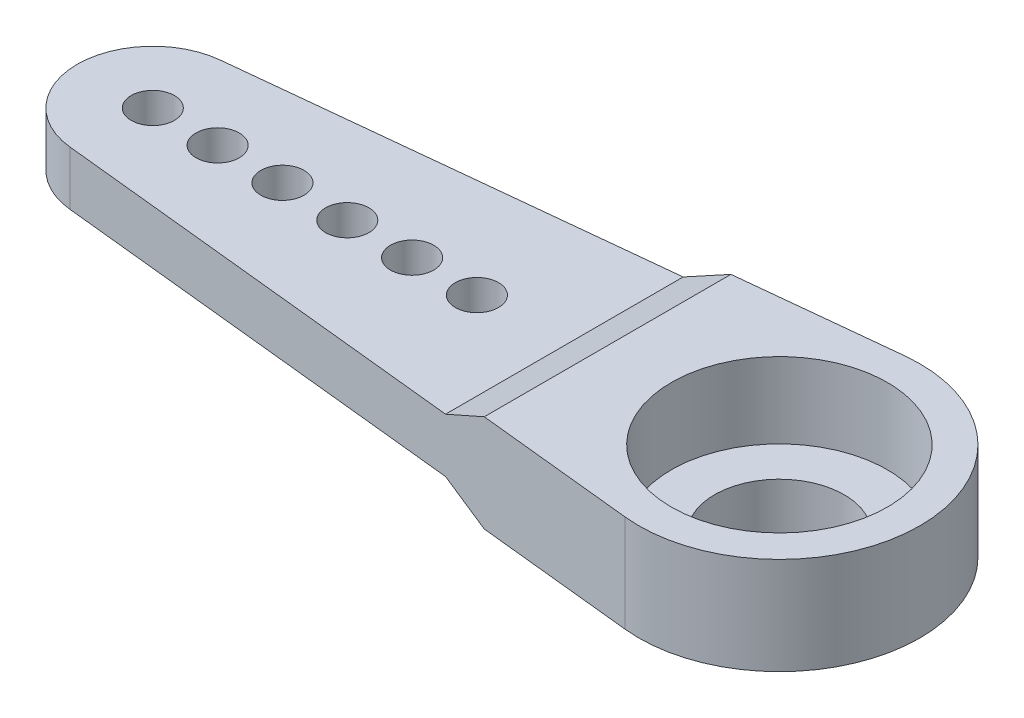
ISO-10303-21;
HEADER;
FILE_DESCRIPTION(('STEP AP214'),'2;1');
FILE_NAME('part.step','',(''),(''),'','','');
FILE_SCHEMA(('AUTOMOTIVE_DESIGN { 1 0 10303 214 1 1 1 1 }'));
ENDSEC;
DATA;
#1=APPLICATION_CONTEXT('core data for automotive mechanical design processes');
#2=APPLICATION_PROTOCOL_DEFINITION('international standard','automotive_design',2000,#1);
#3=PRODUCT_CONTEXT('',#1,'mechanical');
#4=PRODUCT('Part','Part','',(#3));
#5=PRODUCT_RELATED_PRODUCT_CATEGORY('part','',(#4));
#6=PRODUCT_DEFINITION_FORMATION('','',#4);
#7=PRODUCT_DEFINITION_CONTEXT('part definition',#1,'design');
#8=PRODUCT_DEFINITION('design','',#6,#7);
#9=PRODUCT_DEFINITION_SHAPE('','',#8);
#10=(LENGTH_UNIT() NAMED_UNIT(*) SI_UNIT(.MILLI.,.METRE.));
#11=(NAMED_UNIT(*) PLANE_ANGLE_UNIT() SI_UNIT($,.RADIAN.));
#12=(NAMED_UNIT(*) SI_UNIT($,.STERADIAN.) SOLID_ANGLE_UNIT());
#13=UNCERTAINTY_MEASURE_WITH_UNIT(LENGTH_MEASURE(1.E-05),#10,'distance_accuracy_value','');
#14=(GEOMETRIC_REPRESENTATION_CONTEXT(3) GLOBAL_UNCERTAINTY_ASSIGNED_CONTEXT((#13)) GLOBAL_UNIT_ASSIGNED_CONTEXT((#10,
#11,#12)) REPRESENTATION_CONTEXT('',''));
#15=CARTESIAN_POINT('',(0.,0.,0.));
#16=DIRECTION('',(0.,0.,1.));
#17=DIRECTION('',(1.,0.,0.));
#18=AXIS2_PLACEMENT_3D('',#15,#16,#17);
#19=CARTESIAN_POINT('',(0.,0.,0.));
#20=DIRECTION('',(0.,1.,0.));
#21=DIRECTION('',(0.,0.,1.));
#22=AXIS2_PLACEMENT_3D('',#19,#20,#21);
#23=PLANE('',#22);
#24=CARTESIAN_POINT('',(-14.,0.,0.));
#25=DIRECTION('',(0.,1.,0.));
#26=DIRECTION('',(0.,0.,1.));
#27=AXIS2_PLACEMENT_3D('',#24,#25,#26);
#28=CIRCLE('',#27,1.);
#29=CARTESIAN_POINT('',(-14.,0.,1.));
#30=VERTEX_POINT('',#29);
#31=EDGE_CURVE('E201',#30,#30,#28,.T.);
#32=ORIENTED_EDGE('',*,*,#31,.T.);
#33=EDGE_LOOP('',(#32));
#34=FACE_BOUND('',#33,.T.);
#35=CARTESIAN_POINT('',(-17.,0.,0.));
#36=DIRECTION('',(0.,1.,0.));
#37=DIRECTION('',(0.,0.,1.));
#38=AXIS2_PLACEMENT_3D('',#35,#36,#37);
#39=CIRCLE('',#38,1.);
#40=CARTESIAN_POINT('',(-17.,0.,1.));
#41=VERTEX_POINT('',#40);
#42=EDGE_CURVE('E198',#41,#41,#39,.T.);
#43=ORIENTED_EDGE('',*,*,#42,.T.);
#44=EDGE_LOOP('',(#43));
#45=FACE_BOUND('',#44,.T.);
#46=CARTESIAN_POINT('',(-20.,0.,0.));
#47=DIRECTION('',(0.,1.,0.));
#48=DIRECTION('',(0.,0.,1.));
#49=AXIS2_PLACEMENT_3D('',#46,#47,#48);
#50=CIRCLE('',#49,1.);
#51=CARTESIAN_POINT('',(-20.,0.,1.));
#52=VERTEX_POINT('',#51);
#53=EDGE_CURVE('E195',#52,#52,#50,.T.);
#54=ORIENTED_EDGE('',*,*,#53,.T.);
#55=EDGE_LOOP('',(#54));
#56=FACE_BOUND('',#55,.T.);
#57=CARTESIAN_POINT('',(-23.,0.,0.));
#58=DIRECTION('',(0.,1.,0.));
#59=DIRECTION('',(0.,0.,1.));
#60=AXIS2_PLACEMENT_3D('',#57,#58,#59);
#61=CIRCLE('',#60,0.999999999999998);
#62=CARTESIAN_POINT('',(-23.,0.,0.999999999999998));
#63=VERTEX_POINT('',#62);
#64=EDGE_CURVE('E192',#63,#63,#61,.T.);
#65=ORIENTED_EDGE('',*,*,#64,.T.);
#66=EDGE_LOOP('',(#65));
#67=FACE_BOUND('',#66,.T.);
#68=CARTESIAN_POINT('',(-26.,0.,0.));
#69=DIRECTION('',(0.,1.,0.));
#70=DIRECTION('',(0.,0.,1.));
#71=AXIS2_PLACEMENT_3D('',#68,#69,#70);
#72=CIRCLE('',#71,1.);
#73=CARTESIAN_POINT('',(-26.,0.,1.));
#74=VERTEX_POINT('',#73);
#75=EDGE_CURVE('E189',#74,#74,#72,.T.);
#76=ORIENTED_EDGE('',*,*,#75,.T.);
#77=EDGE_LOOP('',(#76));
#78=FACE_BOUND('',#77,.T.);
#79=CARTESIAN_POINT('',(-29.,0.,0.));
#80=DIRECTION('',(0.,1.,0.));
#81=DIRECTION('',(0.,0.,1.));
#82=AXIS2_PLACEMENT_3D('',#79,#80,#81);
#83=CIRCLE('',#82,0.999999999999998);
#84=CARTESIAN_POINT('',(-29.,0.,0.999999999999998));
#85=VERTEX_POINT('',#84);
#86=EDGE_CURVE('E158',#85,#85,#83,.T.);
#87=ORIENTED_EDGE('',*,*,#86,.T.);
#88=EDGE_LOOP('',(#87));
#89=FACE_BOUND('',#88,.T.);
#90=DIRECTION('',(0.,0.,-1.));
#91=VECTOR('',#90,1.);
#92=CARTESIAN_POINT('',(-9.95191462652814,0.,0.));
#93=LINE('',#92,#91);
#94=CARTESIAN_POINT('',(-9.95191462652814,0.,5.5));
#95=VERTEX_POINT('',#94);
#96=CARTESIAN_POINT('',(-9.95191462652814,0.,-5.5));
#97=VERTEX_POINT('',#96);
#98=EDGE_CURVE('E127',#95,#97,#93,.T.);
#99=ORIENTED_EDGE('',*,*,#98,.F.);
#100=DIRECTION('',(0.994634834610756,0.,0.103448275862069));
#101=VECTOR('',#100,1.);
#102=CARTESIAN_POINT('',(-0.672413793103447,0.,6.46512642496991));
#103=LINE('',#102,#101);
#104=CARTESIAN_POINT('',(-29.3620689655172,0.,3.48122192113765));
#105=VERTEX_POINT('',#104);
#106=EDGE_CURVE('E165',#105,#95,#103,.T.);
#107=ORIENTED_EDGE('',*,*,#106,.F.);
#108=CARTESIAN_POINT('',(-29.,0.,0.));
#109=DIRECTION('',(0.,1.,0.));
#110=DIRECTION('',(0.,0.,1.));
#111=AXIS2_PLACEMENT_3D('',#108,#109,#110);
#112=CIRCLE('',#111,3.5);
#113=CARTESIAN_POINT('',(-29.3620689655172,0.,-3.48122192113764));
#114=VERTEX_POINT('',#113);
#115=EDGE_CURVE('E206',#114,#105,#112,.T.);
#116=ORIENTED_EDGE('',*,*,#115,.F.);
#117=DIRECTION('',(-0.994634834610756,0.,0.103448275862069));
#118=VECTOR('',#117,1.);
#119=CARTESIAN_POINT('',(-0.672413793103448,0.,-6.46512642496991));
#120=LINE('',#119,#118);
#121=EDGE_CURVE('E204',#97,#114,#120,.T.);
#122=ORIENTED_EDGE('',*,*,#121,.F.);
#123=EDGE_LOOP('',(#99,#107,#116,#122));
#124=FACE_BOUND('',#123,.T.);
#125=ADVANCED_FACE('F53',(#34,#45,#56,#67,#78,#89,#124),#23,.F.);
#126=CARTESIAN_POINT('',(-0.672413793103448,2.5,-6.46512642496991));
#127=DIRECTION('',(0.103448275862069,0.,0.994634834610756));
#128=DIRECTION('',(0.994634834610756,0.,-0.103448275862069));
#129=AXIS2_PLACEMENT_3D('',#126,#127,#128);
#130=PLANE('',#129);
#131=DIRECTION('',(-0.994634834610756,0.,0.103448275862069));
#132=VECTOR('',#131,1.);
#133=CARTESIAN_POINT('',(-0.672413793103448,2.5,-6.46512642496991));
#134=LINE('',#133,#132);
#135=CARTESIAN_POINT('',(-9.95191462652814,2.5,-5.5));
#136=VERTEX_POINT('',#135);
#137=CARTESIAN_POINT('',(-29.3620689655172,2.5,-3.48122192113764));
#138=VERTEX_POINT('',#137);
#139=EDGE_CURVE('E180',#136,#138,#134,.T.);
#140=ORIENTED_EDGE('',*,*,#139,.F.);
#141=DIRECTION('',(0.890582012116265,0.445291006058129,-0.0926261281641659));
#142=VECTOR('',#141,1.);
#143=CARTESIAN_POINT('',(-8.42277522553789,3.26456970049512,-5.65904011108469));
#144=LINE('',#143,#142);
#145=CARTESIAN_POINT('',(-7.95191462652812,3.5,-5.70801257358446));
#146=VERTEX_POINT('',#145);
#147=EDGE_CURVE('E225',#136,#146,#144,.T.);
#148=ORIENTED_EDGE('',*,*,#147,.T.);
#149=DIRECTION('',(0.994634834610756,0.,-0.103448275862069));
#150=VECTOR('',#149,1.);
#151=CARTESIAN_POINT('',(-0.672413793103448,3.5,-6.46512642496991));
#152=LINE('',#151,#150);
#153=CARTESIAN_POINT('',(-0.67241379310344,3.5,-6.46512642496991));
#154=VERTEX_POINT('',#153);
#155=EDGE_CURVE('E153',#146,#154,#152,.T.);
#156=ORIENTED_EDGE('',*,*,#155,.T.);
#157=DIRECTION('',(0.,-1.,0.));
#158=VECTOR('',#157,1.);
#159=CARTESIAN_POINT('',(-0.67241379310345,2.5,-6.46512642496991));
#160=LINE('',#159,#158);
#161=CARTESIAN_POINT('',(-0.67241379310345,-1.,-6.46512642496991));
#162=VERTEX_POINT('',#161);
#163=EDGE_CURVE('E137',#154,#162,#160,.T.);
#164=ORIENTED_EDGE('',*,*,#163,.T.);
#165=DIRECTION('',(-0.994634834610756,0.,0.103448275862069));
#166=VECTOR('',#165,1.);
#167=CARTESIAN_POINT('',(-0.672413793103448,-1.,-6.46512642496991));
#168=LINE('',#167,#166);
#169=CARTESIAN_POINT('',(-7.95191462652812,-1.,-5.70801257358446));
#170=VERTEX_POINT('',#169);
#171=EDGE_CURVE('E142',#162,#170,#168,.T.);
#172=ORIENTED_EDGE('',*,*,#171,.T.);
#173=DIRECTION('',(0.890582012116265,-0.445291006058129,-0.0926261281641659));
#174=VECTOR('',#173,1.);
#175=CARTESIAN_POINT('',(-8.42277522553789,-0.764569700495117,-5.65904011108469));
#176=LINE('',#175,#174);
#177=EDGE_CURVE('E69',#170,#97,#176,.F.);
#178=ORIENTED_EDGE('',*,*,#177,.T.);
#179=ORIENTED_EDGE('',*,*,#121,.T.);
#180=DIRECTION('',(0.,-1.,0.));
#181=VECTOR('',#180,1.);
#182=CARTESIAN_POINT('',(-29.3620689655172,2.5,-3.48122192113764));
#183=LINE('',#182,#181);
#184=EDGE_CURVE('E212',#138,#114,#183,.T.);
#185=ORIENTED_EDGE('',*,*,#184,.F.);
#186=EDGE_LOOP('',(#140,#148,#156,#164,#172,#178,#179,#185));
#187=FACE_BOUND('',#186,.T.);
#188=ADVANCED_FACE('F243',(#187),#130,.F.);
#189=CARTESIAN_POINT('',(-29.,2.5,0.));
#190=DIRECTION('',(0.,-1.,0.));
#191=DIRECTION('',(0.,0.,-1.));
#192=AXIS2_PLACEMENT_3D('',#189,#190,#191);
#193=CYLINDRICAL_SURFACE('',#192,3.5);
#194=ORIENTED_EDGE('',*,*,#115,.T.);
#195=DIRECTION('',(0.,-1.,0.));
#196=VECTOR('',#195,1.);
#197=CARTESIAN_POINT('',(-29.3620689655172,2.5,3.48122192113765));
#198=LINE('',#197,#196);
#199=CARTESIAN_POINT('',(-29.3620689655172,2.5,3.48122192113765));
#200=VERTEX_POINT('',#199);
#201=EDGE_CURVE('E136',#200,#105,#198,.T.);
#202=ORIENTED_EDGE('',*,*,#201,.F.);
#203=CARTESIAN_POINT('',(-29.,2.5,0.));
#204=DIRECTION('',(0.,1.,0.));
#205=DIRECTION('',(0.,0.,1.));
#206=AXIS2_PLACEMENT_3D('',#203,#204,#205);
#207=CIRCLE('',#206,3.5);
#208=EDGE_CURVE('E182',#138,#200,#207,.T.);
#209=ORIENTED_EDGE('',*,*,#208,.F.);
#210=ORIENTED_EDGE('',*,*,#184,.T.);
#211=EDGE_LOOP('',(#194,#202,#209,#210));
#212=FACE_BOUND('',#211,.T.);
#213=ADVANCED_FACE('F249',(#212),#193,.T.);
#214=CARTESIAN_POINT('',(-0.672413793103447,2.5,6.46512642496991));
#215=DIRECTION('',(0.103448275862069,0.,-0.994634834610756));
#216=DIRECTION('',(-0.994634834610756,0.,-0.103448275862069));
#217=AXIS2_PLACEMENT_3D('',#214,#215,#216);
#218=PLANE('',#217);
#219=DIRECTION('',(-0.994634834610756,0.,-0.103448275862069));
#220=VECTOR('',#219,1.);
#221=CARTESIAN_POINT('',(-0.672413793103447,3.5,6.46512642496991));
#222=LINE('',#221,#220);
#223=CARTESIAN_POINT('',(-0.672413793103448,3.5,6.46512642496991));
#224=VERTEX_POINT('',#223);
#225=CARTESIAN_POINT('',(-7.95191462652813,3.5,5.70801257358446));
#226=VERTEX_POINT('',#225);
#227=EDGE_CURVE('E156',#224,#226,#222,.T.);
#228=ORIENTED_EDGE('',*,*,#227,.T.);
#229=DIRECTION('',(-0.890582012116265,-0.445291006058129,-0.0926261281641657));
#230=VECTOR('',#229,1.);
#231=CARTESIAN_POINT('',(-8.42277522553789,3.26456970049512,5.65904011108469));
#232=LINE('',#231,#230);
#233=CARTESIAN_POINT('',(-9.95191462652814,2.5,5.5));
#234=VERTEX_POINT('',#233);
#235=EDGE_CURVE('E222',#226,#234,#232,.T.);
#236=ORIENTED_EDGE('',*,*,#235,.T.);
#237=DIRECTION('',(0.994634834610756,0.,0.103448275862069));
#238=VECTOR('',#237,1.);
#239=CARTESIAN_POINT('',(-0.672413793103447,2.5,6.46512642496991));
#240=LINE('',#239,#238);
#241=EDGE_CURVE('E184',#200,#234,#240,.T.);
#242=ORIENTED_EDGE('',*,*,#241,.F.);
#243=ORIENTED_EDGE('',*,*,#201,.T.);
#244=ORIENTED_EDGE('',*,*,#106,.T.);
#245=DIRECTION('',(-0.890582012116265,0.445291006058129,-0.0926261281641657));
#246=VECTOR('',#245,1.);
#247=CARTESIAN_POINT('',(-8.42277522553789,-0.764569700495117,5.65904011108469));
#248=LINE('',#247,#246);
#249=CARTESIAN_POINT('',(-7.95191462652812,-1.,5.70801257358446));
#250=VERTEX_POINT('',#249);
#251=EDGE_CURVE('E77',#95,#250,#248,.F.);
#252=ORIENTED_EDGE('',*,*,#251,.T.);
#253=DIRECTION('',(0.994634834610756,0.,0.103448275862069));
#254=VECTOR('',#253,1.);
#255=CARTESIAN_POINT('',(-0.672413793103447,-1.,6.46512642496991));
#256=LINE('',#255,#254);
#257=CARTESIAN_POINT('',(-0.672413793103447,-1.,6.46512642496991));
#258=VERTEX_POINT('',#257);
#259=EDGE_CURVE('E118',#250,#258,#256,.T.);
#260=ORIENTED_EDGE('',*,*,#259,.T.);
#261=DIRECTION('',(0.,-1.,0.));
#262=VECTOR('',#261,1.);
#263=CARTESIAN_POINT('',(-0.672413793103447,2.5,6.46512642496991));
#264=LINE('',#263,#262);
#265=EDGE_CURVE('E122',#224,#258,#264,.T.);
#266=ORIENTED_EDGE('',*,*,#265,.F.);
#267=EDGE_LOOP('',(#228,#236,#242,#243,#244,#252,#260,#266));
#268=FACE_BOUND('',#267,.T.);
#269=ADVANCED_FACE('F121',(#268),#218,.F.);
#270=CARTESIAN_POINT('',(0.,2.5,0.));
#271=DIRECTION('',(0.,-1.,0.));
#272=DIRECTION('',(0.,0.,-1.));
#273=AXIS2_PLACEMENT_3D('',#270,#271,#272);
#274=CYLINDRICAL_SURFACE('',#273,6.5);
#275=ORIENTED_EDGE('',*,*,#265,.T.);
#276=CARTESIAN_POINT('',(0.,-1.,0.));
#277=DIRECTION('',(0.,1.,0.));
#278=DIRECTION('',(0.,0.,1.));
#279=AXIS2_PLACEMENT_3D('',#276,#277,#278);
#280=CIRCLE('',#279,6.5);
#281=EDGE_CURVE('E126',#258,#162,#280,.T.);
#282=ORIENTED_EDGE('',*,*,#281,.T.);
#283=ORIENTED_EDGE('',*,*,#163,.F.);
#284=CARTESIAN_POINT('',(0.,3.5,0.));
#285=DIRECTION('',(0.,1.,0.));
#286=DIRECTION('',(0.,0.,1.));
#287=AXIS2_PLACEMENT_3D('',#284,#285,#286);
#288=CIRCLE('',#287,6.5);
#289=EDGE_CURVE('E134',#224,#154,#288,.T.);
#290=ORIENTED_EDGE('',*,*,#289,.F.);
#291=EDGE_LOOP('',(#275,#282,#283,#290));
#292=FACE_BOUND('',#291,.T.);
#293=ADVANCED_FACE('F131',(#292),#274,.T.);
#294=CARTESIAN_POINT('',(-14.,2.5,0.));
#295=DIRECTION('',(0.,-1.,0.));
#296=DIRECTION('',(0.,0.,-1.));
#297=AXIS2_PLACEMENT_3D('',#294,#295,#296);
#298=CYLINDRICAL_SURFACE('',#297,1.);
#299=CARTESIAN_POINT('',(-14.,2.5,0.));
#300=DIRECTION('',(0.,1.,0.));
#301=DIRECTION('',(0.,0.,1.));
#302=AXIS2_PLACEMENT_3D('',#299,#300,#301);
#303=CIRCLE('',#302,1.);
#304=CARTESIAN_POINT('',(-14.,2.5,1.));
#305=VERTEX_POINT('',#304);
#306=EDGE_CURVE('E177',#305,#305,#303,.T.);
#307=ORIENTED_EDGE('',*,*,#306,.T.);
#308=EDGE_LOOP('',(#307));
#309=FACE_BOUND('',#308,.T.);
#310=ORIENTED_EDGE('',*,*,#31,.F.);
#311=EDGE_LOOP('',(#310));
#312=FACE_BOUND('',#311,.T.);
#313=ADVANCED_FACE('F264',(#309,#312),#298,.F.);
#314=CARTESIAN_POINT('',(-17.,2.5,0.));
#315=DIRECTION('',(0.,-1.,0.));
#316=DIRECTION('',(0.,0.,-1.));
#317=AXIS2_PLACEMENT_3D('',#314,#315,#316);
#318=CYLINDRICAL_SURFACE('',#317,1.);
#319=CARTESIAN_POINT('',(-17.,2.5,0.));
#320=DIRECTION('',(0.,1.,0.));
#321=DIRECTION('',(0.,0.,1.));
#322=AXIS2_PLACEMENT_3D('',#319,#320,#321);
#323=CIRCLE('',#322,1.);
#324=CARTESIAN_POINT('',(-17.,2.5,1.));
#325=VERTEX_POINT('',#324);
#326=EDGE_CURVE('E174',#325,#325,#323,.T.);
#327=ORIENTED_EDGE('',*,*,#326,.T.);
#328=EDGE_LOOP('',(#327));
#329=FACE_BOUND('',#328,.T.);
#330=ORIENTED_EDGE('',*,*,#42,.F.);
#331=EDGE_LOOP('',(#330));
#332=FACE_BOUND('',#331,.T.);
#333=ADVANCED_FACE('F272',(#329,#332),#318,.F.);
#334=CARTESIAN_POINT('',(-20.,2.5,0.));
#335=DIRECTION('',(0.,-1.,0.));
#336=DIRECTION('',(0.,0.,-1.));
#337=AXIS2_PLACEMENT_3D('',#334,#335,#336);
#338=CYLINDRICAL_SURFACE('',#337,1.);
#339=CARTESIAN_POINT('',(-20.,2.5,0.));
#340=DIRECTION('',(0.,1.,0.));
#341=DIRECTION('',(0.,0.,1.));
#342=AXIS2_PLACEMENT_3D('',#339,#340,#341);
#343=CIRCLE('',#342,1.);
#344=CARTESIAN_POINT('',(-20.,2.5,1.));
#345=VERTEX_POINT('',#344);
#346=EDGE_CURVE('E171',#345,#345,#343,.T.);
#347=ORIENTED_EDGE('',*,*,#346,.T.);
#348=EDGE_LOOP('',(#347));
#349=FACE_BOUND('',#348,.T.);
#350=ORIENTED_EDGE('',*,*,#53,.F.);
#351=EDGE_LOOP('',(#350));
#352=FACE_BOUND('',#351,.T.);
#353=ADVANCED_FACE('F276',(#349,#352),#338,.F.);
#354=CARTESIAN_POINT('',(-23.,2.5,0.));
#355=DIRECTION('',(0.,-1.,0.));
#356=DIRECTION('',(0.,0.,-1.));
#357=AXIS2_PLACEMENT_3D('',#354,#355,#356);
#358=CYLINDRICAL_SURFACE('',#357,0.999999999999998);
#359=CARTESIAN_POINT('',(-23.,2.5,0.));
#360=DIRECTION('',(0.,1.,0.));
#361=DIRECTION('',(0.,0.,1.));
#362=AXIS2_PLACEMENT_3D('',#359,#360,#361);
#363=CIRCLE('',#362,0.999999999999998);
#364=CARTESIAN_POINT('',(-23.,2.5,0.999999999999998));
#365=VERTEX_POINT('',#364);
#366=EDGE_CURVE('E168',#365,#365,#363,.T.);
#367=ORIENTED_EDGE('',*,*,#366,.T.);
#368=EDGE_LOOP('',(#367));
#369=FACE_BOUND('',#368,.T.);
#370=ORIENTED_EDGE('',*,*,#64,.F.);
#371=EDGE_LOOP('',(#370));
#372=FACE_BOUND('',#371,.T.);
#373=ADVANCED_FACE('F280',(#369,#372),#358,.F.);
#374=CARTESIAN_POINT('',(-26.,2.5,0.));
#375=DIRECTION('',(0.,-1.,0.));
#376=DIRECTION('',(0.,0.,-1.));
#377=AXIS2_PLACEMENT_3D('',#374,#375,#376);
#378=CYLINDRICAL_SURFACE('',#377,1.);
#379=CARTESIAN_POINT('',(-26.,2.5,0.));
#380=DIRECTION('',(0.,1.,0.));
#381=DIRECTION('',(0.,0.,1.));
#382=AXIS2_PLACEMENT_3D('',#379,#380,#381);
#383=CIRCLE('',#382,1.);
#384=CARTESIAN_POINT('',(-26.,2.5,1.));
#385=VERTEX_POINT('',#384);
#386=EDGE_CURVE('E164',#385,#385,#383,.T.);
#387=ORIENTED_EDGE('',*,*,#386,.T.);
#388=EDGE_LOOP('',(#387));
#389=FACE_BOUND('',#388,.T.);
#390=ORIENTED_EDGE('',*,*,#75,.F.);
#391=EDGE_LOOP('',(#390));
#392=FACE_BOUND('',#391,.T.);
#393=ADVANCED_FACE('F284',(#389,#392),#378,.F.);
#394=CARTESIAN_POINT('',(-29.,2.5,0.));
#395=DIRECTION('',(0.,-1.,0.));
#396=DIRECTION('',(0.,0.,-1.));
#397=AXIS2_PLACEMENT_3D('',#394,#395,#396);
#398=CYLINDRICAL_SURFACE('',#397,0.999999999999998);
#399=CARTESIAN_POINT('',(-29.,2.5,0.));
#400=DIRECTION('',(0.,1.,0.));
#401=DIRECTION('',(0.,0.,1.));
#402=AXIS2_PLACEMENT_3D('',#399,#400,#401);
#403=CIRCLE('',#402,0.999999999999998);
#404=CARTESIAN_POINT('',(-29.,2.5,0.999999999999998));
#405=VERTEX_POINT('',#404);
#406=EDGE_CURVE('E161',#405,#405,#403,.T.);
#407=ORIENTED_EDGE('',*,*,#406,.T.);
#408=EDGE_LOOP('',(#407));
#409=FACE_BOUND('',#408,.T.);
#410=ORIENTED_EDGE('',*,*,#86,.F.);
#411=EDGE_LOOP('',(#410));
#412=FACE_BOUND('',#411,.T.);
#413=ADVANCED_FACE('F260',(#409,#412),#398,.F.);
#414=CARTESIAN_POINT('',(0.,2.5,0.));
#415=DIRECTION('',(0.,-1.,0.));
#416=DIRECTION('',(0.,0.,-1.));
#417=AXIS2_PLACEMENT_3D('',#414,#415,#416);
#418=CYLINDRICAL_SURFACE('',#417,5.);
#419=CARTESIAN_POINT('',(0.,0.,0.));
#420=DIRECTION('',(0.,1.,0.));
#421=DIRECTION('',(0.,0.,1.));
#422=AXIS2_PLACEMENT_3D('',#419,#420,#421);
#423=CIRCLE('',#422,5.);
#424=CARTESIAN_POINT('',(0.,0.,5.));
#425=VERTEX_POINT('',#424);
#426=EDGE_CURVE('E215',#425,#425,#423,.T.);
#427=ORIENTED_EDGE('',*,*,#426,.F.);
#428=EDGE_LOOP('',(#427));
#429=FACE_BOUND('',#428,.T.);
#430=CARTESIAN_POINT('',(0.,3.5,0.));
#431=DIRECTION('',(0.,1.,0.));
#432=DIRECTION('',(0.,0.,1.));
#433=AXIS2_PLACEMENT_3D('',#430,#431,#432);
#434=CIRCLE('',#433,5.);
#435=CARTESIAN_POINT('',(0.,3.5,5.));
#436=VERTEX_POINT('',#435);
#437=EDGE_CURVE('E144',#436,#436,#434,.T.);
#438=ORIENTED_EDGE('',*,*,#437,.T.);
#439=EDGE_LOOP('',(#438));
#440=FACE_BOUND('',#439,.T.);
#441=ADVANCED_FACE('F257',(#429,#440),#418,.F.);
#442=CARTESIAN_POINT('',(0.,2.5,0.));
#443=DIRECTION('',(0.,1.,0.));
#444=DIRECTION('',(0.,0.,1.));
#445=AXIS2_PLACEMENT_3D('',#442,#443,#444);
#446=PLANE('',#445);
#447=DIRECTION('',(0.,0.,1.));
#448=VECTOR('',#447,1.);
#449=CARTESIAN_POINT('',(-9.95191462652814,2.5,0.));
#450=LINE('',#449,#448);
#451=EDGE_CURVE('E152',#136,#234,#450,.T.);
#452=ORIENTED_EDGE('',*,*,#451,.F.);
#453=ORIENTED_EDGE('',*,*,#139,.T.);
#454=ORIENTED_EDGE('',*,*,#208,.T.);
#455=ORIENTED_EDGE('',*,*,#241,.T.);
#456=EDGE_LOOP('',(#452,#453,#454,#455));
#457=FACE_BOUND('',#456,.T.);
#458=ORIENTED_EDGE('',*,*,#406,.F.);
#459=EDGE_LOOP('',(#458));
#460=FACE_BOUND('',#459,.T.);
#461=ORIENTED_EDGE('',*,*,#386,.F.);
#462=EDGE_LOOP('',(#461));
#463=FACE_BOUND('',#462,.T.);
#464=ORIENTED_EDGE('',*,*,#366,.F.);
#465=EDGE_LOOP('',(#464));
#466=FACE_BOUND('',#465,.T.);
#467=ORIENTED_EDGE('',*,*,#346,.F.);
#468=EDGE_LOOP('',(#467));
#469=FACE_BOUND('',#468,.T.);
#470=ORIENTED_EDGE('',*,*,#326,.F.);
#471=EDGE_LOOP('',(#470));
#472=FACE_BOUND('',#471,.T.);
#473=ORIENTED_EDGE('',*,*,#306,.F.);
#474=EDGE_LOOP('',(#473));
#475=FACE_BOUND('',#474,.T.);
#476=ADVANCED_FACE('F255',(#457,#460,#463,#466,#469,#472,#475),#446,.T.);
#477=CARTESIAN_POINT('',(0.,3.5,0.));
#478=DIRECTION('',(0.,1.,0.));
#479=DIRECTION('',(0.,0.,1.));
#480=AXIS2_PLACEMENT_3D('',#477,#478,#479);
#481=PLANE('',#480);
#482=ORIENTED_EDGE('',*,*,#155,.F.);
#483=DIRECTION('',(0.,0.,1.));
#484=VECTOR('',#483,1.);
#485=CARTESIAN_POINT('',(-7.95191462652812,3.5,5.5));
#486=LINE('',#485,#484);
#487=EDGE_CURVE('E218',#146,#226,#486,.T.);
#488=ORIENTED_EDGE('',*,*,#487,.T.);
#489=ORIENTED_EDGE('',*,*,#227,.F.);
#490=ORIENTED_EDGE('',*,*,#289,.T.);
#491=EDGE_LOOP('',(#482,#488,#489,#490));
#492=FACE_BOUND('',#491,.T.);
#493=ORIENTED_EDGE('',*,*,#437,.F.);
#494=EDGE_LOOP('',(#493));
#495=FACE_BOUND('',#494,.T.);
#496=ADVANCED_FACE('F315',(#492,#495),#481,.T.);
#497=CARTESIAN_POINT('',(0.,-1.,0.));
#498=DIRECTION('',(0.,1.,0.));
#499=DIRECTION('',(0.,0.,1.));
#500=AXIS2_PLACEMENT_3D('',#497,#498,#499);
#501=PLANE('',#500);
#502=CARTESIAN_POINT('',(0.,-1.,0.));
#503=DIRECTION('',(0.,1.,0.));
#504=DIRECTION('',(0.,0.,1.));
#505=AXIS2_PLACEMENT_3D('',#502,#503,#504);
#506=CIRCLE('',#505,5.);
#507=CARTESIAN_POINT('',(0.,-1.,5.));
#508=VERTEX_POINT('',#507);
#509=EDGE_CURVE('E149',#508,#508,#506,.T.);
#510=ORIENTED_EDGE('',*,*,#509,.T.);
#511=EDGE_LOOP('',(#510));
#512=FACE_BOUND('',#511,.T.);
#513=ORIENTED_EDGE('',*,*,#259,.F.);
#514=DIRECTION('',(0.,0.,-1.));
#515=VECTOR('',#514,1.);
#516=CARTESIAN_POINT('',(-7.95191462652812,-1.,0.));
#517=LINE('',#516,#515);
#518=EDGE_CURVE('E227',#250,#170,#517,.T.);
#519=ORIENTED_EDGE('',*,*,#518,.T.);
#520=ORIENTED_EDGE('',*,*,#171,.F.);
#521=ORIENTED_EDGE('',*,*,#281,.F.);
#522=EDGE_LOOP('',(#513,#519,#520,#521));
#523=FACE_BOUND('',#522,.T.);
#524=ADVANCED_FACE('F140',(#512,#523),#501,.F.);
#525=CARTESIAN_POINT('',(0.,-2.5,0.));
#526=DIRECTION('',(0.,1.,0.));
#527=DIRECTION('',(0.,0.,1.));
#528=AXIS2_PLACEMENT_3D('',#525,#526,#527);
#529=CYLINDRICAL_SURFACE('',#528,5.);
#530=CARTESIAN_POINT('',(0.,-1.5,0.));
#531=DIRECTION('',(0.,1.,0.));
#532=DIRECTION('',(0.,0.,1.));
#533=AXIS2_PLACEMENT_3D('',#530,#531,#532);
#534=CIRCLE('',#533,5.);
#535=CARTESIAN_POINT('',(0.,-1.5,5.));
#536=VERTEX_POINT('',#535);
#537=EDGE_CURVE('E62',#536,#536,#534,.T.);
#538=ORIENTED_EDGE('',*,*,#537,.T.);
#539=EDGE_LOOP('',(#538));
#540=FACE_BOUND('',#539,.T.);
#541=ORIENTED_EDGE('',*,*,#509,.F.);
#542=EDGE_LOOP('',(#541));
#543=FACE_BOUND('',#542,.T.);
#544=ADVANCED_FACE('F231',(#540,#543),#529,.T.);
#545=CARTESIAN_POINT('',(0.,-2.5,0.));
#546=DIRECTION('',(0.,1.,0.));
#547=DIRECTION('',(0.,0.,1.));
#548=AXIS2_PLACEMENT_3D('',#545,#546,#547);
#549=CYLINDRICAL_SURFACE('',#548,3.);
#550=CARTESIAN_POINT('',(0.,-2.5,0.));
#551=DIRECTION('',(0.,1.,0.));
#552=DIRECTION('',(0.,0.,1.));
#553=AXIS2_PLACEMENT_3D('',#550,#551,#552);
#554=CIRCLE('',#553,3.);
#555=CARTESIAN_POINT('',(0.,-2.5,3.));
#556=VERTEX_POINT('',#555);
#557=EDGE_CURVE('E376',#556,#556,#554,.T.);
#558=ORIENTED_EDGE('',*,*,#557,.F.);
#559=EDGE_LOOP('',(#558));
#560=FACE_BOUND('',#559,.T.);
#561=CARTESIAN_POINT('',(0.,0.,0.));
#562=DIRECTION('',(0.,1.,0.));
#563=DIRECTION('',(0.,0.,1.));
#564=AXIS2_PLACEMENT_3D('',#561,#562,#563);
#565=CIRCLE('',#564,3.);
#566=CARTESIAN_POINT('',(0.,0.,3.));
#567=VERTEX_POINT('',#566);
#568=EDGE_CURVE('E377',#567,#567,#565,.T.);
#569=ORIENTED_EDGE('',*,*,#568,.T.);
#570=EDGE_LOOP('',(#569));
#571=FACE_BOUND('',#570,.T.);
#572=ADVANCED_FACE('F365',(#560,#571),#549,.F.);
#573=CARTESIAN_POINT('',(0.,-2.5,0.));
#574=DIRECTION('',(0.,1.,0.));
#575=DIRECTION('',(0.,0.,1.));
#576=AXIS2_PLACEMENT_3D('',#573,#574,#575);
#577=PLANE('',#576);
#578=CARTESIAN_POINT('',(0.,-2.5,0.));
#579=DIRECTION('',(0.,1.,0.));
#580=DIRECTION('',(0.,0.,1.));
#581=AXIS2_PLACEMENT_3D('',#578,#579,#580);
#582=CIRCLE('',#581,3.99999999999999);
#583=CARTESIAN_POINT('',(0.,-2.5,3.99999999999999));
#584=VERTEX_POINT('',#583);
#585=EDGE_CURVE('E12',#584,#584,#582,.F.);
#586=ORIENTED_EDGE('',*,*,#585,.T.);
#587=EDGE_LOOP('',(#586));
#588=FACE_BOUND('',#587,.T.);
#589=ORIENTED_EDGE('',*,*,#557,.T.);
#590=EDGE_LOOP('',(#589));
#591=FACE_BOUND('',#590,.T.);
#592=ADVANCED_FACE('F306',(#588,#591),#577,.F.);
#593=CARTESIAN_POINT('',(0.,0.,0.));
#594=DIRECTION('',(0.,1.,0.));
#595=DIRECTION('',(0.,0.,1.));
#596=AXIS2_PLACEMENT_3D('',#593,#594,#595);
#597=PLANE('',#596);
#598=ORIENTED_EDGE('',*,*,#426,.T.);
#599=EDGE_LOOP('',(#598));
#600=FACE_BOUND('',#599,.T.);
#601=ORIENTED_EDGE('',*,*,#568,.F.);
#602=EDGE_LOOP('',(#601));
#603=FACE_BOUND('',#602,.T.);
#604=ADVANCED_FACE('F297',(#600,#603),#597,.T.);
#605=CARTESIAN_POINT('',(-7.95191462652812,3.5,0.));
#606=DIRECTION('',(-0.447213595499955,0.894427190999917,0.));
#607=DIRECTION('',(0.,0.,-1.));
#608=AXIS2_PLACEMENT_3D('',#605,#606,#607);
#609=PLANE('',#608);
#610=ORIENTED_EDGE('',*,*,#147,.F.);
#611=ORIENTED_EDGE('',*,*,#451,.T.);
#612=ORIENTED_EDGE('',*,*,#235,.F.);
#613=ORIENTED_EDGE('',*,*,#487,.F.);
#614=EDGE_LOOP('',(#610,#611,#612,#613));
#615=FACE_BOUND('',#614,.T.);
#616=ADVANCED_FACE('F240',(#615),#609,.T.);
#617=CARTESIAN_POINT('',(-7.95191462652812,-1.,0.));
#618=DIRECTION('',(0.447213595499955,0.894427190999917,0.));
#619=DIRECTION('',(0.,0.,-1.));
#620=AXIS2_PLACEMENT_3D('',#617,#618,#619);
#621=PLANE('',#620);
#622=ORIENTED_EDGE('',*,*,#251,.F.);
#623=ORIENTED_EDGE('',*,*,#98,.T.);
#624=ORIENTED_EDGE('',*,*,#177,.F.);
#625=ORIENTED_EDGE('',*,*,#518,.F.);
#626=EDGE_LOOP('',(#622,#623,#624,#625));
#627=FACE_BOUND('',#626,.T.);
#628=ADVANCED_FACE('F235',(#627),#621,.F.);
#629=CARTESIAN_POINT('',(0.,-1.5,0.));
#630=DIRECTION('',(0.,1.,0.));
#631=DIRECTION('',(0.,0.,1.));
#632=AXIS2_PLACEMENT_3D('',#629,#630,#631);
#633=CONICAL_SURFACE('',#632,5.,0.78539816339745);
#634=ORIENTED_EDGE('',*,*,#585,.F.);
#635=EDGE_LOOP('',(#634));
#636=FACE_BOUND('',#635,.T.);
#637=ORIENTED_EDGE('',*,*,#537,.F.);
#638=EDGE_LOOP('',(#637));
#639=FACE_BOUND('',#638,.T.);
#640=ADVANCED_FACE('F56',(#636,#639),#633,.T.);
#641=CLOSED_SHELL('',(#125,#188,#213,#269,#293,#313,#333,#353,#373,#393,#413,#441,#476,#496,
#524,#544,#572,#592,#604,#616,#628,#640));
#642=MANIFOLD_SOLID_BREP('B2',#641);
#643=ADVANCED_BREP_SHAPE_REPRESENTATION('',(#18,#642),#14);
#644=SHAPE_DEFINITION_REPRESENTATION(#9,#643);
ENDSEC;
END-ISO-10303-21;
